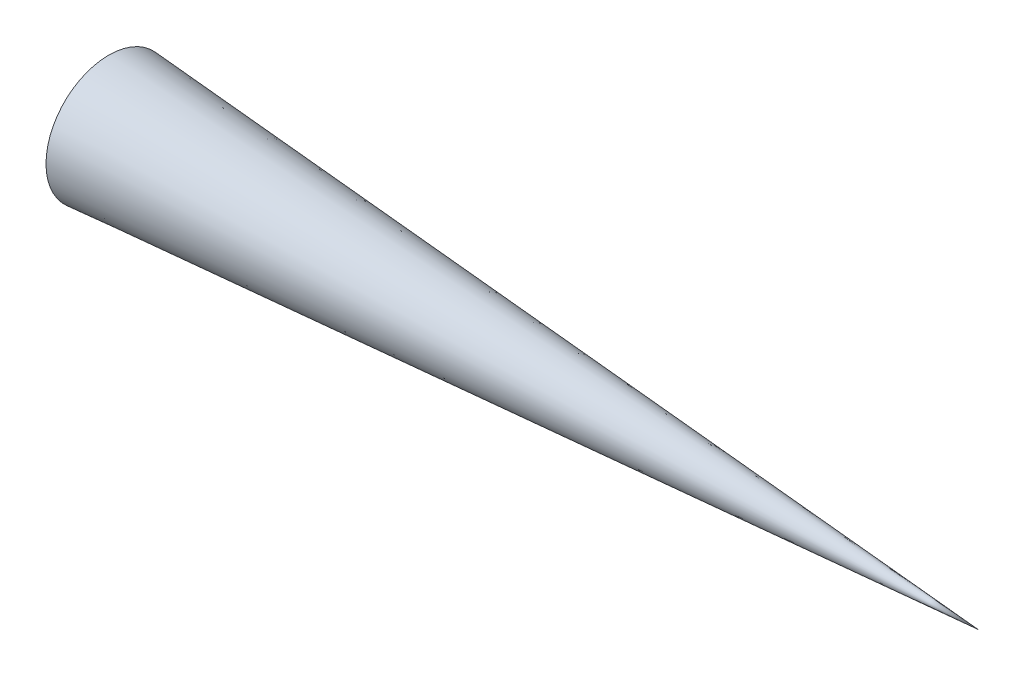
ISO-10303-21;
HEADER;
FILE_DESCRIPTION(('STEP AP214'),'2;1');
FILE_NAME('part.step','',(''),(''),'','','');
FILE_SCHEMA(('AUTOMOTIVE_DESIGN { 1 0 10303 214 1 1 1 1 }'));
ENDSEC;
DATA;
#1=APPLICATION_CONTEXT('core data for automotive mechanical design processes');
#2=APPLICATION_PROTOCOL_DEFINITION('international standard','automotive_design',2000,#1);
#3=PRODUCT_CONTEXT('',#1,'mechanical');
#4=PRODUCT('Part','Part','',(#3));
#5=PRODUCT_RELATED_PRODUCT_CATEGORY('part','',(#4));
#6=PRODUCT_DEFINITION_FORMATION('','',#4);
#7=PRODUCT_DEFINITION_CONTEXT('part definition',#1,'design');
#8=PRODUCT_DEFINITION('design','',#6,#7);
#9=PRODUCT_DEFINITION_SHAPE('','',#8);
#10=(LENGTH_UNIT() NAMED_UNIT(*) SI_UNIT(.MILLI.,.METRE.));
#11=(NAMED_UNIT(*) PLANE_ANGLE_UNIT() SI_UNIT($,.RADIAN.));
#12=(NAMED_UNIT(*) SI_UNIT($,.STERADIAN.) SOLID_ANGLE_UNIT());
#13=UNCERTAINTY_MEASURE_WITH_UNIT(LENGTH_MEASURE(1.E-05),#10,'distance_accuracy_value','');
#14=(GEOMETRIC_REPRESENTATION_CONTEXT(3) GLOBAL_UNCERTAINTY_ASSIGNED_CONTEXT((#13)) GLOBAL_UNIT_ASSIGNED_CONTEXT((#10,
#11,#12)) REPRESENTATION_CONTEXT('',''));
#15=CARTESIAN_POINT('',(0.,0.,0.));
#16=DIRECTION('',(0.,0.,1.));
#17=DIRECTION('',(1.,0.,0.));
#18=AXIS2_PLACEMENT_3D('',#15,#16,#17);
#19=CARTESIAN_POINT('',(0.,0.,0.));
#20=DIRECTION('',(-1.,0.,0.));
#21=DIRECTION('',(0.,-1.,0.));
#22=AXIS2_PLACEMENT_3D('',#19,#20,#21);
#23=CONICAL_SURFACE('',#22,14.505,0.072038936032616);
#24=CARTESIAN_POINT('',(201.001019114241,0.,0.));
#25=VERTEX_POINT('',#24);
#26=VERTEX_LOOP('',#25);
#27=FACE_BOUND('',#26,.T.);
#28=CARTESIAN_POINT('',(0.,0.,0.));
#29=DIRECTION('',(1.,0.,0.));
#30=DIRECTION('',(0.,1.,0.));
#31=AXIS2_PLACEMENT_3D('',#28,#29,#30);
#32=CIRCLE('',#31,14.505);
#33=CARTESIAN_POINT('',(0.,14.505,0.));
#34=VERTEX_POINT('',#33);
#35=EDGE_CURVE('E11',#34,#34,#32,.T.);
#36=ORIENTED_EDGE('',*,*,#35,.F.);
#37=EDGE_LOOP('',(#36));
#38=FACE_BOUND('',#37,.T.);
#39=ADVANCED_FACE('F33',(#27,#38),#23,.F.);
#40=CARTESIAN_POINT('',(0.,14.505,0.));
#41=DIRECTION('',(-1.,0.,0.));
#42=DIRECTION('',(0.,-1.,0.));
#43=AXIS2_PLACEMENT_3D('',#40,#41,#42);
#44=PLANE('',#43);
#45=ORIENTED_EDGE('',*,*,#35,.T.);
#46=EDGE_LOOP('',(#45));
#47=FACE_BOUND('',#46,.T.);
#48=CARTESIAN_POINT('',(0.,0.,0.));
#49=DIRECTION('',(1.,0.,0.));
#50=DIRECTION('',(0.,1.,0.));
#51=AXIS2_PLACEMENT_3D('',#48,#49,#50);
#52=CIRCLE('',#51,15.266976324413);
#53=CARTESIAN_POINT('',(0.,15.266976324413,0.));
#54=VERTEX_POINT('',#53);
#55=EDGE_CURVE('E40',#54,#54,#52,.T.);
#56=ORIENTED_EDGE('',*,*,#55,.F.);
#57=EDGE_LOOP('',(#56));
#58=FACE_BOUND('',#57,.T.);
#59=ADVANCED_FACE('F48',(#47,#58),#44,.T.);
#60=CARTESIAN_POINT('',(211.56,0.,0.));
#61=DIRECTION('',(-1.,0.,0.));
#62=DIRECTION('',(0.,-1.,0.));
#63=AXIS2_PLACEMENT_3D('',#60,#61,#62);
#64=CONICAL_SURFACE('',#63,0.,0.072038936032616);
#65=ORIENTED_EDGE('',*,*,#55,.T.);
#66=EDGE_LOOP('',(#65));
#67=FACE_BOUND('',#66,.T.);
#68=CARTESIAN_POINT('',(211.56,0.,0.));
#69=VERTEX_POINT('',#68);
#70=VERTEX_LOOP('',#69);
#71=FACE_BOUND('',#70,.T.);
#72=ADVANCED_FACE('F53',(#67,#71),#64,.T.);
#73=CLOSED_SHELL('',(#39,#59,#72));
#74=MANIFOLD_SOLID_BREP('B2',#73);
#75=ADVANCED_BREP_SHAPE_REPRESENTATION('',(#18,#74),#14);
#76=SHAPE_DEFINITION_REPRESENTATION(#9,#75);
ENDSEC;
END-ISO-10303-21;
